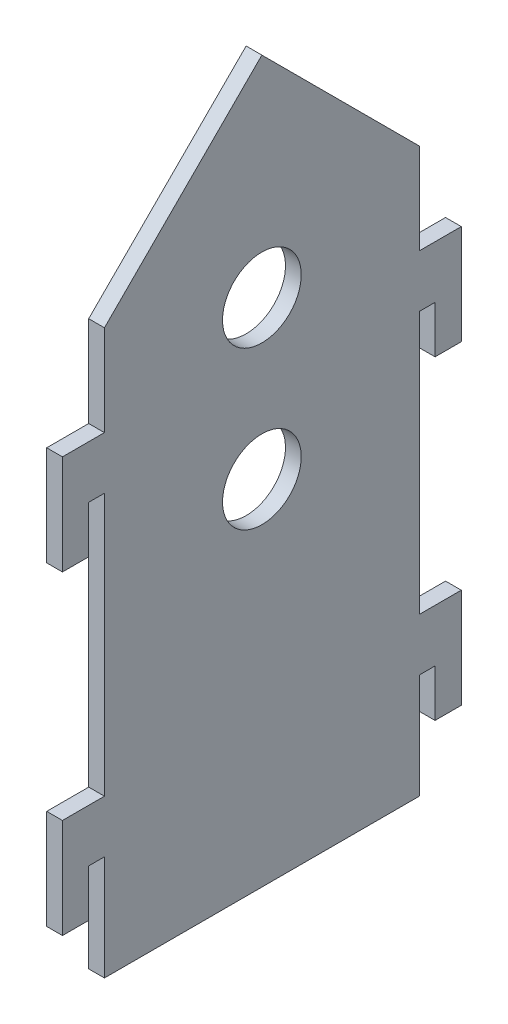
ISO-10303-21;
HEADER;
FILE_DESCRIPTION(('STEP AP214'),'2;1');
FILE_NAME('part.step','',(''),(''),'','','');
FILE_SCHEMA(('AUTOMOTIVE_DESIGN { 1 0 10303 214 1 1 1 1 }'));
ENDSEC;
DATA;
#1=APPLICATION_CONTEXT('core data for automotive mechanical design processes');
#2=APPLICATION_PROTOCOL_DEFINITION('international standard','automotive_design',2000,#1);
#3=PRODUCT_CONTEXT('',#1,'mechanical');
#4=PRODUCT('Part','Part','',(#3));
#5=PRODUCT_RELATED_PRODUCT_CATEGORY('part','',(#4));
#6=PRODUCT_DEFINITION_FORMATION('','',#4);
#7=PRODUCT_DEFINITION_CONTEXT('part definition',#1,'design');
#8=PRODUCT_DEFINITION('design','',#6,#7);
#9=PRODUCT_DEFINITION_SHAPE('','',#8);
#10=(LENGTH_UNIT() NAMED_UNIT(*) SI_UNIT(.MILLI.,.METRE.));
#11=(NAMED_UNIT(*) PLANE_ANGLE_UNIT() SI_UNIT($,.RADIAN.));
#12=(NAMED_UNIT(*) SI_UNIT($,.STERADIAN.) SOLID_ANGLE_UNIT());
#13=UNCERTAINTY_MEASURE_WITH_UNIT(LENGTH_MEASURE(1.E-05),#10,'distance_accuracy_value','');
#14=(GEOMETRIC_REPRESENTATION_CONTEXT(3) GLOBAL_UNCERTAINTY_ASSIGNED_CONTEXT((#13)) GLOBAL_UNIT_ASSIGNED_CONTEXT((#10,
#11,#12)) REPRESENTATION_CONTEXT('',''));
#15=CARTESIAN_POINT('',(0.,0.,0.));
#16=DIRECTION('',(0.,0.,1.));
#17=DIRECTION('',(1.,0.,0.));
#18=AXIS2_PLACEMENT_3D('',#15,#16,#17);
#19=CARTESIAN_POINT('',(-63.,0.,0.));
#20=DIRECTION('',(-1.,0.,0.));
#21=DIRECTION('',(0.,0.,1.));
#22=AXIS2_PLACEMENT_3D('',#19,#20,#21);
#23=PLANE('',#22);
#24=CARTESIAN_POINT('',(-63.,137.3,-33.));
#25=DIRECTION('',(-1.,0.,0.));
#26=DIRECTION('',(0.,0.,1.));
#27=AXIS2_PLACEMENT_3D('',#24,#25,#26);
#28=CIRCLE('',#27,7.4999999999999);
#29=CARTESIAN_POINT('',(-63.,137.3,-25.5000000000001));
#30=VERTEX_POINT('',#29);
#31=EDGE_CURVE('E262',#30,#30,#28,.T.);
#32=ORIENTED_EDGE('',*,*,#31,.F.);
#33=EDGE_LOOP('',(#32));
#34=FACE_BOUND('',#33,.T.);
#35=DIRECTION('',(0.,-1.,0.));
#36=VECTOR('',#35,1.);
#37=CARTESIAN_POINT('',(-63.,40.,-63.));
#38=LINE('',#37,#36);
#39=CARTESIAN_POINT('',(-63.,60.,-63.));
#40=VERTEX_POINT('',#39);
#41=CARTESIAN_POINT('',(-63.,40.,-63.));
#42=VERTEX_POINT('',#41);
#43=EDGE_CURVE('E315',#40,#42,#38,.T.);
#44=ORIENTED_EDGE('',*,*,#43,.T.);
#45=DIRECTION('',(0.,0.,1.));
#46=VECTOR('',#45,1.);
#47=CARTESIAN_POINT('',(-63.,40.,-63.));
#48=LINE('',#47,#46);
#49=CARTESIAN_POINT('',(-63.,40.,-3.00000000000002));
#50=VERTEX_POINT('',#49);
#51=EDGE_CURVE('E158',#42,#50,#48,.T.);
#52=ORIENTED_EDGE('',*,*,#51,.T.);
#53=DIRECTION('',(0.,1.,0.));
#54=VECTOR('',#53,1.);
#55=CARTESIAN_POINT('',(-63.,40.,-3.00000000000002));
#56=LINE('',#55,#54);
#57=CARTESIAN_POINT('',(-63.,60.,-3.00000000000002));
#58=VERTEX_POINT('',#57);
#59=EDGE_CURVE('E393',#50,#58,#56,.T.);
#60=ORIENTED_EDGE('',*,*,#59,.T.);
#61=DIRECTION('',(0.,0.,1.));
#62=VECTOR('',#61,1.);
#63=CARTESIAN_POINT('',(-63.,60.,-3.00000000000002));
#64=LINE('',#63,#62);
#65=CARTESIAN_POINT('',(-63.,60.,0.));
#66=VERTEX_POINT('',#65);
#67=EDGE_CURVE('E412',#58,#66,#64,.T.);
#68=ORIENTED_EDGE('',*,*,#67,.T.);
#69=DIRECTION('',(0.,-1.,0.));
#70=VECTOR('',#69,1.);
#71=CARTESIAN_POINT('',(-63.,60.,0.));
#72=LINE('',#71,#70);
#73=CARTESIAN_POINT('',(-63.,51.,0.));
#74=VERTEX_POINT('',#73);
#75=EDGE_CURVE('E409',#66,#74,#72,.T.);
#76=ORIENTED_EDGE('',*,*,#75,.T.);
#77=DIRECTION('',(0.,0.,1.));
#78=VECTOR('',#77,1.);
#79=CARTESIAN_POINT('',(-63.,51.,4.99999999999999));
#80=LINE('',#79,#78);
#81=CARTESIAN_POINT('',(-63.,51.,4.99999999999999));
#82=VERTEX_POINT('',#81);
#83=EDGE_CURVE('E411',#74,#82,#80,.T.);
#84=ORIENTED_EDGE('',*,*,#83,.T.);
#85=DIRECTION('',(0.,1.,0.));
#86=VECTOR('',#85,1.);
#87=CARTESIAN_POINT('',(-63.,70.,4.99999999999998));
#88=LINE('',#87,#86);
#89=CARTESIAN_POINT('',(-63.,70.,4.99999999999998));
#90=VERTEX_POINT('',#89);
#91=EDGE_CURVE('E414',#82,#90,#88,.T.);
#92=ORIENTED_EDGE('',*,*,#91,.T.);
#93=DIRECTION('',(0.,0.,-1.));
#94=VECTOR('',#93,1.);
#95=CARTESIAN_POINT('',(-63.,70.,-3.00000000000002));
#96=LINE('',#95,#94);
#97=CARTESIAN_POINT('',(-63.,70.,-3.00000000000002));
#98=VERTEX_POINT('',#97);
#99=EDGE_CURVE('E420',#90,#98,#96,.T.);
#100=ORIENTED_EDGE('',*,*,#99,.T.);
#101=DIRECTION('',(0.,1.,0.));
#102=VECTOR('',#101,1.);
#103=CARTESIAN_POINT('',(-63.,70.,-3.00000000000002));
#104=LINE('',#103,#102);
#105=CARTESIAN_POINT('',(-63.,120.,-3.));
#106=VERTEX_POINT('',#105);
#107=EDGE_CURVE('E422',#98,#106,#104,.T.);
#108=ORIENTED_EDGE('',*,*,#107,.T.);
#109=DIRECTION('',(0.,0.,1.));
#110=VECTOR('',#109,1.);
#111=CARTESIAN_POINT('',(-63.,120.,-3.));
#112=LINE('',#111,#110);
#113=CARTESIAN_POINT('',(-63.,120.,0.));
#114=VERTEX_POINT('',#113);
#115=EDGE_CURVE('E424',#106,#114,#112,.T.);
#116=ORIENTED_EDGE('',*,*,#115,.T.);
#117=DIRECTION('',(0.,-1.,0.));
#118=VECTOR('',#117,1.);
#119=CARTESIAN_POINT('',(-63.,120.,0.));
#120=LINE('',#119,#118);
#121=CARTESIAN_POINT('',(-63.,111.,0.));
#122=VERTEX_POINT('',#121);
#123=EDGE_CURVE('E426',#114,#122,#120,.T.);
#124=ORIENTED_EDGE('',*,*,#123,.T.);
#125=DIRECTION('',(0.,0.,1.));
#126=VECTOR('',#125,1.);
#127=CARTESIAN_POINT('',(-63.,111.,5.));
#128=LINE('',#127,#126);
#129=CARTESIAN_POINT('',(-63.,111.,5.));
#130=VERTEX_POINT('',#129);
#131=EDGE_CURVE('E428',#122,#130,#128,.T.);
#132=ORIENTED_EDGE('',*,*,#131,.T.);
#133=DIRECTION('',(0.,1.,0.));
#134=VECTOR('',#133,1.);
#135=CARTESIAN_POINT('',(-63.,130.,5.));
#136=LINE('',#135,#134);
#137=CARTESIAN_POINT('',(-63.,130.,5.));
#138=VERTEX_POINT('',#137);
#139=EDGE_CURVE('E430',#130,#138,#136,.T.);
#140=ORIENTED_EDGE('',*,*,#139,.T.);
#141=DIRECTION('',(0.,0.,-1.));
#142=VECTOR('',#141,1.);
#143=CARTESIAN_POINT('',(-63.,130.,-3.));
#144=LINE('',#143,#142);
#145=CARTESIAN_POINT('',(-63.,130.,-3.));
#146=VERTEX_POINT('',#145);
#147=EDGE_CURVE('E432',#138,#146,#144,.T.);
#148=ORIENTED_EDGE('',*,*,#147,.T.);
#149=DIRECTION('',(0.,1.,0.));
#150=VECTOR('',#149,1.);
#151=CARTESIAN_POINT('',(-63.,130.,-3.));
#152=LINE('',#151,#150);
#153=CARTESIAN_POINT('',(-63.,147.3,-3.00000000000002));
#154=VERTEX_POINT('',#153);
#155=EDGE_CURVE('E434',#146,#154,#152,.T.);
#156=ORIENTED_EDGE('',*,*,#155,.T.);
#157=DIRECTION('',(0.,0.707106781186546,-0.707106781186549));
#158=VECTOR('',#157,1.);
#159=CARTESIAN_POINT('',(-63.,147.3,-3.00000000000002));
#160=LINE('',#159,#158);
#161=CARTESIAN_POINT('',(-63.,177.3,-33.0000000000001));
#162=VERTEX_POINT('',#161);
#163=EDGE_CURVE('E436',#154,#162,#160,.T.);
#164=ORIENTED_EDGE('',*,*,#163,.T.);
#165=DIRECTION('',(0.,-0.707106781186549,-0.707106781186546));
#166=VECTOR('',#165,1.);
#167=CARTESIAN_POINT('',(-63.,147.3,-63.));
#168=LINE('',#167,#166);
#169=CARTESIAN_POINT('',(-63.,147.3,-63.));
#170=VERTEX_POINT('',#169);
#171=EDGE_CURVE('E438',#162,#170,#168,.T.);
#172=ORIENTED_EDGE('',*,*,#171,.T.);
#173=DIRECTION('',(0.,-1.,0.));
#174=VECTOR('',#173,1.);
#175=CARTESIAN_POINT('',(-63.,130.,-63.));
#176=LINE('',#175,#174);
#177=CARTESIAN_POINT('',(-63.,130.,-63.));
#178=VERTEX_POINT('',#177);
#179=EDGE_CURVE('E440',#170,#178,#176,.T.);
#180=ORIENTED_EDGE('',*,*,#179,.T.);
#181=DIRECTION('',(0.,0.,-1.));
#182=VECTOR('',#181,1.);
#183=CARTESIAN_POINT('',(-63.,130.,-63.));
#184=LINE('',#183,#182);
#185=CARTESIAN_POINT('',(-63.,130.,-71.));
#186=VERTEX_POINT('',#185);
#187=EDGE_CURVE('E442',#178,#186,#184,.T.);
#188=ORIENTED_EDGE('',*,*,#187,.T.);
#189=DIRECTION('',(0.,-1.,0.));
#190=VECTOR('',#189,1.);
#191=CARTESIAN_POINT('',(-63.,130.,-71.));
#192=LINE('',#191,#190);
#193=CARTESIAN_POINT('',(-63.,111.,-71.));
#194=VERTEX_POINT('',#193);
#195=EDGE_CURVE('E444',#186,#194,#192,.T.);
#196=ORIENTED_EDGE('',*,*,#195,.T.);
#197=DIRECTION('',(0.,0.,1.));
#198=VECTOR('',#197,1.);
#199=CARTESIAN_POINT('',(-63.,111.,-66.));
#200=LINE('',#199,#198);
#201=CARTESIAN_POINT('',(-63.,111.,-66.));
#202=VERTEX_POINT('',#201);
#203=EDGE_CURVE('E446',#194,#202,#200,.T.);
#204=ORIENTED_EDGE('',*,*,#203,.T.);
#205=DIRECTION('',(0.,1.,0.));
#206=VECTOR('',#205,1.);
#207=CARTESIAN_POINT('',(-63.,120.,-66.));
#208=LINE('',#207,#206);
#209=CARTESIAN_POINT('',(-63.,120.,-66.));
#210=VERTEX_POINT('',#209);
#211=EDGE_CURVE('E448',#202,#210,#208,.T.);
#212=ORIENTED_EDGE('',*,*,#211,.T.);
#213=DIRECTION('',(0.,0.,1.));
#214=VECTOR('',#213,1.);
#215=CARTESIAN_POINT('',(-63.,120.,-63.));
#216=LINE('',#215,#214);
#217=CARTESIAN_POINT('',(-63.,120.,-63.));
#218=VERTEX_POINT('',#217);
#219=EDGE_CURVE('E450',#210,#218,#216,.T.);
#220=ORIENTED_EDGE('',*,*,#219,.T.);
#221=DIRECTION('',(0.,-1.,0.));
#222=VECTOR('',#221,1.);
#223=CARTESIAN_POINT('',(-63.,70.,-63.));
#224=LINE('',#223,#222);
#225=CARTESIAN_POINT('',(-63.,70.,-63.));
#226=VERTEX_POINT('',#225);
#227=EDGE_CURVE('E452',#218,#226,#224,.T.);
#228=ORIENTED_EDGE('',*,*,#227,.T.);
#229=DIRECTION('',(0.,0.,-1.));
#230=VECTOR('',#229,1.);
#231=CARTESIAN_POINT('',(-63.,70.,-63.));
#232=LINE('',#231,#230);
#233=CARTESIAN_POINT('',(-63.,70.,-71.));
#234=VERTEX_POINT('',#233);
#235=EDGE_CURVE('E454',#226,#234,#232,.T.);
#236=ORIENTED_EDGE('',*,*,#235,.T.);
#237=DIRECTION('',(0.,-1.,0.));
#238=VECTOR('',#237,1.);
#239=CARTESIAN_POINT('',(-63.,70.,-71.));
#240=LINE('',#239,#238);
#241=CARTESIAN_POINT('',(-63.,51.,-71.));
#242=VERTEX_POINT('',#241);
#243=EDGE_CURVE('E240',#234,#242,#240,.T.);
#244=ORIENTED_EDGE('',*,*,#243,.T.);
#245=DIRECTION('',(0.,0.,1.));
#246=VECTOR('',#245,1.);
#247=CARTESIAN_POINT('',(-63.,51.,-71.));
#248=LINE('',#247,#246);
#249=CARTESIAN_POINT('',(-63.,51.,-66.));
#250=VERTEX_POINT('',#249);
#251=EDGE_CURVE('E234',#242,#250,#248,.T.);
#252=ORIENTED_EDGE('',*,*,#251,.T.);
#253=DIRECTION('',(0.,1.,0.));
#254=VECTOR('',#253,1.);
#255=CARTESIAN_POINT('',(-63.,60.,-66.));
#256=LINE('',#255,#254);
#257=CARTESIAN_POINT('',(-63.,60.,-66.));
#258=VERTEX_POINT('',#257);
#259=EDGE_CURVE('E238',#250,#258,#256,.T.);
#260=ORIENTED_EDGE('',*,*,#259,.T.);
#261=DIRECTION('',(0.,0.,1.));
#262=VECTOR('',#261,1.);
#263=CARTESIAN_POINT('',(-63.,60.,-63.));
#264=LINE('',#263,#262);
#265=EDGE_CURVE('E52',#258,#40,#264,.T.);
#266=ORIENTED_EDGE('',*,*,#265,.T.);
#267=EDGE_LOOP('',(#44,#52,#60,#68,#76,#84,#92,#100,#108,#116,#124,#132,#140,#148,#156,#164,
#172,#180,#188,#196,#204,#212,#220,#228,#236,#244,#252,#260,#266));
#268=FACE_BOUND('',#267,.T.);
#269=CARTESIAN_POINT('',(-63.,107.3,-33.));
#270=DIRECTION('',(-1.,0.,0.));
#271=DIRECTION('',(0.,0.,1.));
#272=AXIS2_PLACEMENT_3D('',#269,#270,#271);
#273=CIRCLE('',#272,7.4999999999999);
#274=CARTESIAN_POINT('',(-63.,107.3,-25.5000000000001));
#275=VERTEX_POINT('',#274);
#276=EDGE_CURVE('E496',#275,#275,#273,.T.);
#277=ORIENTED_EDGE('',*,*,#276,.F.);
#278=EDGE_LOOP('',(#277));
#279=FACE_BOUND('',#278,.T.);
#280=ADVANCED_FACE('F35',(#34,#268,#279),#23,.T.);
#281=CARTESIAN_POINT('',(-60.,0.,0.));
#282=DIRECTION('',(-1.,0.,0.));
#283=DIRECTION('',(0.,0.,1.));
#284=AXIS2_PLACEMENT_3D('',#281,#282,#283);
#285=PLANE('',#284);
#286=DIRECTION('',(0.,-1.,0.));
#287=VECTOR('',#286,1.);
#288=CARTESIAN_POINT('',(-60.,40.,-63.));
#289=LINE('',#288,#287);
#290=CARTESIAN_POINT('',(-60.,60.,-63.));
#291=VERTEX_POINT('',#290);
#292=CARTESIAN_POINT('',(-60.,40.,-63.));
#293=VERTEX_POINT('',#292);
#294=EDGE_CURVE('E258',#291,#293,#289,.T.);
#295=ORIENTED_EDGE('',*,*,#294,.F.);
#296=DIRECTION('',(0.,0.,1.));
#297=VECTOR('',#296,1.);
#298=CARTESIAN_POINT('',(-60.,60.,-63.));
#299=LINE('',#298,#297);
#300=CARTESIAN_POINT('',(-60.,60.,-66.));
#301=VERTEX_POINT('',#300);
#302=EDGE_CURVE('E150',#301,#291,#299,.T.);
#303=ORIENTED_EDGE('',*,*,#302,.F.);
#304=DIRECTION('',(0.,1.,0.));
#305=VECTOR('',#304,1.);
#306=CARTESIAN_POINT('',(-60.,60.,-66.));
#307=LINE('',#306,#305);
#308=CARTESIAN_POINT('',(-60.,51.,-66.));
#309=VERTEX_POINT('',#308);
#310=EDGE_CURVE('E144',#309,#301,#307,.T.);
#311=ORIENTED_EDGE('',*,*,#310,.F.);
#312=DIRECTION('',(0.,0.,1.));
#313=VECTOR('',#312,1.);
#314=CARTESIAN_POINT('',(-60.,51.,-71.));
#315=LINE('',#314,#313);
#316=CARTESIAN_POINT('',(-60.,51.,-71.));
#317=VERTEX_POINT('',#316);
#318=EDGE_CURVE('E248',#317,#309,#315,.T.);
#319=ORIENTED_EDGE('',*,*,#318,.F.);
#320=DIRECTION('',(0.,-1.,0.));
#321=VECTOR('',#320,1.);
#322=CARTESIAN_POINT('',(-60.,70.,-71.));
#323=LINE('',#322,#321);
#324=CARTESIAN_POINT('',(-60.,70.,-71.));
#325=VERTEX_POINT('',#324);
#326=EDGE_CURVE('E310',#325,#317,#323,.T.);
#327=ORIENTED_EDGE('',*,*,#326,.F.);
#328=DIRECTION('',(0.,0.,-1.));
#329=VECTOR('',#328,1.);
#330=CARTESIAN_POINT('',(-60.,70.,-63.));
#331=LINE('',#330,#329);
#332=CARTESIAN_POINT('',(-60.,70.,-63.));
#333=VERTEX_POINT('',#332);
#334=EDGE_CURVE('E308',#333,#325,#331,.T.);
#335=ORIENTED_EDGE('',*,*,#334,.F.);
#336=DIRECTION('',(0.,-1.,0.));
#337=VECTOR('',#336,1.);
#338=CARTESIAN_POINT('',(-60.,70.,-63.));
#339=LINE('',#338,#337);
#340=CARTESIAN_POINT('',(-60.,120.,-63.));
#341=VERTEX_POINT('',#340);
#342=EDGE_CURVE('E306',#341,#333,#339,.T.);
#343=ORIENTED_EDGE('',*,*,#342,.F.);
#344=DIRECTION('',(0.,0.,1.));
#345=VECTOR('',#344,1.);
#346=CARTESIAN_POINT('',(-60.,120.,-63.));
#347=LINE('',#346,#345);
#348=CARTESIAN_POINT('',(-60.,120.,-66.));
#349=VERTEX_POINT('',#348);
#350=EDGE_CURVE('E304',#349,#341,#347,.T.);
#351=ORIENTED_EDGE('',*,*,#350,.F.);
#352=DIRECTION('',(0.,1.,0.));
#353=VECTOR('',#352,1.);
#354=CARTESIAN_POINT('',(-60.,120.,-66.));
#355=LINE('',#354,#353);
#356=CARTESIAN_POINT('',(-60.,111.,-66.));
#357=VERTEX_POINT('',#356);
#358=EDGE_CURVE('E302',#357,#349,#355,.T.);
#359=ORIENTED_EDGE('',*,*,#358,.F.);
#360=DIRECTION('',(0.,0.,1.));
#361=VECTOR('',#360,1.);
#362=CARTESIAN_POINT('',(-60.,111.,-66.));
#363=LINE('',#362,#361);
#364=CARTESIAN_POINT('',(-60.,111.,-71.));
#365=VERTEX_POINT('',#364);
#366=EDGE_CURVE('E300',#365,#357,#363,.T.);
#367=ORIENTED_EDGE('',*,*,#366,.F.);
#368=DIRECTION('',(0.,-1.,0.));
#369=VECTOR('',#368,1.);
#370=CARTESIAN_POINT('',(-60.,130.,-71.));
#371=LINE('',#370,#369);
#372=CARTESIAN_POINT('',(-60.,130.,-71.));
#373=VERTEX_POINT('',#372);
#374=EDGE_CURVE('E298',#373,#365,#371,.T.);
#375=ORIENTED_EDGE('',*,*,#374,.F.);
#376=DIRECTION('',(0.,0.,-1.));
#377=VECTOR('',#376,1.);
#378=CARTESIAN_POINT('',(-60.,130.,-63.));
#379=LINE('',#378,#377);
#380=CARTESIAN_POINT('',(-60.,130.,-63.));
#381=VERTEX_POINT('',#380);
#382=EDGE_CURVE('E296',#381,#373,#379,.T.);
#383=ORIENTED_EDGE('',*,*,#382,.F.);
#384=DIRECTION('',(0.,-1.,0.));
#385=VECTOR('',#384,1.);
#386=CARTESIAN_POINT('',(-60.,130.,-63.));
#387=LINE('',#386,#385);
#388=CARTESIAN_POINT('',(-60.,147.3,-63.));
#389=VERTEX_POINT('',#388);
#390=EDGE_CURVE('E294',#389,#381,#387,.T.);
#391=ORIENTED_EDGE('',*,*,#390,.F.);
#392=DIRECTION('',(0.,-0.707106781186549,-0.707106781186546));
#393=VECTOR('',#392,1.);
#394=CARTESIAN_POINT('',(-60.,147.3,-63.));
#395=LINE('',#394,#393);
#396=CARTESIAN_POINT('',(-60.,177.3,-33.0000000000001));
#397=VERTEX_POINT('',#396);
#398=EDGE_CURVE('E292',#397,#389,#395,.T.);
#399=ORIENTED_EDGE('',*,*,#398,.F.);
#400=DIRECTION('',(0.,0.707106781186546,-0.707106781186549));
#401=VECTOR('',#400,1.);
#402=CARTESIAN_POINT('',(-60.,147.3,-3.00000000000002));
#403=LINE('',#402,#401);
#404=CARTESIAN_POINT('',(-60.,147.3,-3.00000000000002));
#405=VERTEX_POINT('',#404);
#406=EDGE_CURVE('E290',#405,#397,#403,.T.);
#407=ORIENTED_EDGE('',*,*,#406,.F.);
#408=DIRECTION('',(0.,1.,0.));
#409=VECTOR('',#408,1.);
#410=CARTESIAN_POINT('',(-60.,130.,-3.));
#411=LINE('',#410,#409);
#412=CARTESIAN_POINT('',(-60.,130.,-3.));
#413=VERTEX_POINT('',#412);
#414=EDGE_CURVE('E288',#413,#405,#411,.T.);
#415=ORIENTED_EDGE('',*,*,#414,.F.);
#416=DIRECTION('',(0.,0.,-1.));
#417=VECTOR('',#416,1.);
#418=CARTESIAN_POINT('',(-60.,130.,-3.));
#419=LINE('',#418,#417);
#420=CARTESIAN_POINT('',(-60.,130.,5.));
#421=VERTEX_POINT('',#420);
#422=EDGE_CURVE('E286',#421,#413,#419,.T.);
#423=ORIENTED_EDGE('',*,*,#422,.F.);
#424=DIRECTION('',(0.,1.,0.));
#425=VECTOR('',#424,1.);
#426=CARTESIAN_POINT('',(-60.,130.,5.));
#427=LINE('',#426,#425);
#428=CARTESIAN_POINT('',(-60.,111.,5.));
#429=VERTEX_POINT('',#428);
#430=EDGE_CURVE('E284',#429,#421,#427,.T.);
#431=ORIENTED_EDGE('',*,*,#430,.F.);
#432=DIRECTION('',(0.,0.,1.));
#433=VECTOR('',#432,1.);
#434=CARTESIAN_POINT('',(-60.,111.,5.));
#435=LINE('',#434,#433);
#436=CARTESIAN_POINT('',(-60.,111.,0.));
#437=VERTEX_POINT('',#436);
#438=EDGE_CURVE('E282',#437,#429,#435,.T.);
#439=ORIENTED_EDGE('',*,*,#438,.F.);
#440=DIRECTION('',(0.,-1.,0.));
#441=VECTOR('',#440,1.);
#442=CARTESIAN_POINT('',(-60.,120.,0.));
#443=LINE('',#442,#441);
#444=CARTESIAN_POINT('',(-60.,120.,0.));
#445=VERTEX_POINT('',#444);
#446=EDGE_CURVE('E280',#445,#437,#443,.T.);
#447=ORIENTED_EDGE('',*,*,#446,.F.);
#448=DIRECTION('',(0.,0.,1.));
#449=VECTOR('',#448,1.);
#450=CARTESIAN_POINT('',(-60.,120.,-3.));
#451=LINE('',#450,#449);
#452=CARTESIAN_POINT('',(-60.,120.,-3.));
#453=VERTEX_POINT('',#452);
#454=EDGE_CURVE('E278',#453,#445,#451,.T.);
#455=ORIENTED_EDGE('',*,*,#454,.F.);
#456=DIRECTION('',(0.,1.,0.));
#457=VECTOR('',#456,1.);
#458=CARTESIAN_POINT('',(-60.,70.,-3.00000000000002));
#459=LINE('',#458,#457);
#460=CARTESIAN_POINT('',(-60.,70.,-3.00000000000002));
#461=VERTEX_POINT('',#460);
#462=EDGE_CURVE('E276',#461,#453,#459,.T.);
#463=ORIENTED_EDGE('',*,*,#462,.F.);
#464=DIRECTION('',(0.,0.,-1.));
#465=VECTOR('',#464,1.);
#466=CARTESIAN_POINT('',(-60.,70.,-3.00000000000002));
#467=LINE('',#466,#465);
#468=CARTESIAN_POINT('',(-60.,70.,4.99999999999998));
#469=VERTEX_POINT('',#468);
#470=EDGE_CURVE('E274',#469,#461,#467,.T.);
#471=ORIENTED_EDGE('',*,*,#470,.F.);
#472=DIRECTION('',(0.,1.,0.));
#473=VECTOR('',#472,1.);
#474=CARTESIAN_POINT('',(-60.,70.,4.99999999999998));
#475=LINE('',#474,#473);
#476=CARTESIAN_POINT('',(-60.,51.,4.99999999999999));
#477=VERTEX_POINT('',#476);
#478=EDGE_CURVE('E272',#477,#469,#475,.T.);
#479=ORIENTED_EDGE('',*,*,#478,.F.);
#480=DIRECTION('',(0.,0.,1.));
#481=VECTOR('',#480,1.);
#482=CARTESIAN_POINT('',(-60.,51.,4.99999999999999));
#483=LINE('',#482,#481);
#484=CARTESIAN_POINT('',(-60.,51.,0.));
#485=VERTEX_POINT('',#484);
#486=EDGE_CURVE('E270',#485,#477,#483,.T.);
#487=ORIENTED_EDGE('',*,*,#486,.F.);
#488=DIRECTION('',(0.,-1.,0.));
#489=VECTOR('',#488,1.);
#490=CARTESIAN_POINT('',(-60.,60.,0.));
#491=LINE('',#490,#489);
#492=CARTESIAN_POINT('',(-60.,60.,0.));
#493=VERTEX_POINT('',#492);
#494=EDGE_CURVE('E268',#493,#485,#491,.T.);
#495=ORIENTED_EDGE('',*,*,#494,.F.);
#496=DIRECTION('',(0.,0.,1.));
#497=VECTOR('',#496,1.);
#498=CARTESIAN_POINT('',(-60.,60.,-3.00000000000002));
#499=LINE('',#498,#497);
#500=CARTESIAN_POINT('',(-60.,60.,-3.00000000000002));
#501=VERTEX_POINT('',#500);
#502=EDGE_CURVE('E266',#501,#493,#499,.T.);
#503=ORIENTED_EDGE('',*,*,#502,.F.);
#504=DIRECTION('',(0.,1.,0.));
#505=VECTOR('',#504,1.);
#506=CARTESIAN_POINT('',(-60.,40.,-3.00000000000002));
#507=LINE('',#506,#505);
#508=CARTESIAN_POINT('',(-60.,40.,-3.00000000000002));
#509=VERTEX_POINT('',#508);
#510=EDGE_CURVE('E264',#509,#501,#507,.T.);
#511=ORIENTED_EDGE('',*,*,#510,.F.);
#512=DIRECTION('',(0.,0.,1.));
#513=VECTOR('',#512,1.);
#514=CARTESIAN_POINT('',(-60.,40.,-63.));
#515=LINE('',#514,#513);
#516=EDGE_CURVE('E261',#293,#509,#515,.T.);
#517=ORIENTED_EDGE('',*,*,#516,.F.);
#518=EDGE_LOOP('',(#295,#303,#311,#319,#327,#335,#343,#351,#359,#367,#375,#383,#391,#399,#407,
#415,#423,#431,#439,#447,#455,#463,#471,#479,#487,#495,#503,#511,#517));
#519=FACE_BOUND('',#518,.T.);
#520=CARTESIAN_POINT('',(-60.,137.3,-33.));
#521=DIRECTION('',(-1.,0.,0.));
#522=DIRECTION('',(0.,0.,1.));
#523=AXIS2_PLACEMENT_3D('',#520,#521,#522);
#524=CIRCLE('',#523,7.4999999999999);
#525=CARTESIAN_POINT('',(-60.,137.3,-25.5000000000001));
#526=VERTEX_POINT('',#525);
#527=EDGE_CURVE('E502',#526,#526,#524,.T.);
#528=ORIENTED_EDGE('',*,*,#527,.T.);
#529=EDGE_LOOP('',(#528));
#530=FACE_BOUND('',#529,.T.);
#531=CARTESIAN_POINT('',(-60.,107.3,-33.));
#532=DIRECTION('',(-1.,0.,0.));
#533=DIRECTION('',(0.,0.,1.));
#534=AXIS2_PLACEMENT_3D('',#531,#532,#533);
#535=CIRCLE('',#534,7.4999999999999);
#536=CARTESIAN_POINT('',(-60.,107.3,-25.5000000000001));
#537=VERTEX_POINT('',#536);
#538=EDGE_CURVE('E499',#537,#537,#535,.T.);
#539=ORIENTED_EDGE('',*,*,#538,.T.);
#540=EDGE_LOOP('',(#539));
#541=FACE_BOUND('',#540,.T.);
#542=ADVANCED_FACE('F397',(#519,#530,#541),#285,.F.);
#543=CARTESIAN_POINT('',(-63.,40.,-63.));
#544=DIRECTION('',(0.,0.,1.));
#545=DIRECTION('',(1.,0.,0.));
#546=AXIS2_PLACEMENT_3D('',#543,#544,#545);
#547=PLANE('',#546);
#548=ORIENTED_EDGE('',*,*,#294,.T.);
#549=DIRECTION('',(1.,0.,0.));
#550=VECTOR('',#549,1.);
#551=CARTESIAN_POINT('',(-63.,40.,-63.));
#552=LINE('',#551,#550);
#553=EDGE_CURVE('E11',#42,#293,#552,.T.);
#554=ORIENTED_EDGE('',*,*,#553,.F.);
#555=ORIENTED_EDGE('',*,*,#43,.F.);
#556=DIRECTION('',(1.,0.,0.));
#557=VECTOR('',#556,1.);
#558=CARTESIAN_POINT('',(-63.,60.,-63.));
#559=LINE('',#558,#557);
#560=EDGE_CURVE('E254',#40,#291,#559,.T.);
#561=ORIENTED_EDGE('',*,*,#560,.T.);
#562=EDGE_LOOP('',(#548,#554,#555,#561));
#563=FACE_BOUND('',#562,.T.);
#564=ADVANCED_FACE('F37',(#563),#547,.F.);
#565=CARTESIAN_POINT('',(-63.,40.,-63.));
#566=DIRECTION('',(0.,1.,0.));
#567=DIRECTION('',(0.,0.,1.));
#568=AXIS2_PLACEMENT_3D('',#565,#566,#567);
#569=PLANE('',#568);
#570=ORIENTED_EDGE('',*,*,#516,.T.);
#571=DIRECTION('',(1.,0.,0.));
#572=VECTOR('',#571,1.);
#573=CARTESIAN_POINT('',(-63.,40.,-3.00000000000002));
#574=LINE('',#573,#572);
#575=EDGE_CURVE('E44',#50,#509,#574,.T.);
#576=ORIENTED_EDGE('',*,*,#575,.F.);
#577=ORIENTED_EDGE('',*,*,#51,.F.);
#578=ORIENTED_EDGE('',*,*,#553,.T.);
#579=EDGE_LOOP('',(#570,#576,#577,#578));
#580=FACE_BOUND('',#579,.T.);
#581=ADVANCED_FACE('F768',(#580),#569,.F.);
#582=CARTESIAN_POINT('',(-63.,40.,-3.00000000000002));
#583=DIRECTION('',(0.,0.,-1.));
#584=DIRECTION('',(-1.,0.,0.));
#585=AXIS2_PLACEMENT_3D('',#582,#583,#584);
#586=PLANE('',#585);
#587=ORIENTED_EDGE('',*,*,#510,.T.);
#588=DIRECTION('',(1.,0.,0.));
#589=VECTOR('',#588,1.);
#590=CARTESIAN_POINT('',(-63.,60.,-3.00000000000002));
#591=LINE('',#590,#589);
#592=EDGE_CURVE('E385',#58,#501,#591,.T.);
#593=ORIENTED_EDGE('',*,*,#592,.F.);
#594=ORIENTED_EDGE('',*,*,#59,.F.);
#595=ORIENTED_EDGE('',*,*,#575,.T.);
#596=EDGE_LOOP('',(#587,#593,#594,#595));
#597=FACE_BOUND('',#596,.T.);
#598=ADVANCED_FACE('F391',(#597),#586,.F.);
#599=CARTESIAN_POINT('',(-63.,60.,-3.00000000000002));
#600=DIRECTION('',(0.,1.,0.));
#601=DIRECTION('',(0.,0.,1.));
#602=AXIS2_PLACEMENT_3D('',#599,#600,#601);
#603=PLANE('',#602);
#604=ORIENTED_EDGE('',*,*,#502,.T.);
#605=DIRECTION('',(1.,0.,0.));
#606=VECTOR('',#605,1.);
#607=CARTESIAN_POINT('',(-63.,60.,0.));
#608=LINE('',#607,#606);
#609=EDGE_CURVE('E382',#66,#493,#608,.T.);
#610=ORIENTED_EDGE('',*,*,#609,.F.);
#611=ORIENTED_EDGE('',*,*,#67,.F.);
#612=ORIENTED_EDGE('',*,*,#592,.T.);
#613=EDGE_LOOP('',(#604,#610,#611,#612));
#614=FACE_BOUND('',#613,.T.);
#615=ADVANCED_FACE('F403',(#614),#603,.F.);
#616=CARTESIAN_POINT('',(-63.,60.,0.));
#617=DIRECTION('',(0.,0.,1.));
#618=DIRECTION('',(1.,0.,0.));
#619=AXIS2_PLACEMENT_3D('',#616,#617,#618);
#620=PLANE('',#619);
#621=ORIENTED_EDGE('',*,*,#494,.T.);
#622=DIRECTION('',(1.,0.,0.));
#623=VECTOR('',#622,1.);
#624=CARTESIAN_POINT('',(-63.,51.,0.));
#625=LINE('',#624,#623);
#626=EDGE_CURVE('E379',#74,#485,#625,.T.);
#627=ORIENTED_EDGE('',*,*,#626,.F.);
#628=ORIENTED_EDGE('',*,*,#75,.F.);
#629=ORIENTED_EDGE('',*,*,#609,.T.);
#630=EDGE_LOOP('',(#621,#627,#628,#629));
#631=FACE_BOUND('',#630,.T.);
#632=ADVANCED_FACE('F407',(#631),#620,.F.);
#633=CARTESIAN_POINT('',(-63.,51.,4.99999999999999));
#634=DIRECTION('',(0.,1.,0.));
#635=DIRECTION('',(0.,0.,1.));
#636=AXIS2_PLACEMENT_3D('',#633,#634,#635);
#637=PLANE('',#636);
#638=ORIENTED_EDGE('',*,*,#486,.T.);
#639=DIRECTION('',(1.,0.,0.));
#640=VECTOR('',#639,1.);
#641=CARTESIAN_POINT('',(-63.,51.,4.99999999999999));
#642=LINE('',#641,#640);
#643=EDGE_CURVE('E376',#82,#477,#642,.T.);
#644=ORIENTED_EDGE('',*,*,#643,.F.);
#645=ORIENTED_EDGE('',*,*,#83,.F.);
#646=ORIENTED_EDGE('',*,*,#626,.T.);
#647=EDGE_LOOP('',(#638,#644,#645,#646));
#648=FACE_BOUND('',#647,.T.);
#649=ADVANCED_FACE('F733',(#648),#637,.F.);
#650=CARTESIAN_POINT('',(-63.,70.,4.99999999999998));
#651=DIRECTION('',(0.,0.,-1.));
#652=DIRECTION('',(0.,1.,0.));
#653=AXIS2_PLACEMENT_3D('',#650,#651,#652);
#654=PLANE('',#653);
#655=ORIENTED_EDGE('',*,*,#478,.T.);
#656=DIRECTION('',(1.,0.,0.));
#657=VECTOR('',#656,1.);
#658=CARTESIAN_POINT('',(-63.,70.,4.99999999999998));
#659=LINE('',#658,#657);
#660=EDGE_CURVE('E373',#90,#469,#659,.T.);
#661=ORIENTED_EDGE('',*,*,#660,.F.);
#662=ORIENTED_EDGE('',*,*,#91,.F.);
#663=ORIENTED_EDGE('',*,*,#643,.T.);
#664=EDGE_LOOP('',(#655,#661,#662,#663));
#665=FACE_BOUND('',#664,.T.);
#666=ADVANCED_FACE('F723',(#665),#654,.F.);
#667=CARTESIAN_POINT('',(-63.,70.,-3.00000000000002));
#668=DIRECTION('',(0.,-1.,0.));
#669=DIRECTION('',(0.,0.,-1.));
#670=AXIS2_PLACEMENT_3D('',#667,#668,#669);
#671=PLANE('',#670);
#672=ORIENTED_EDGE('',*,*,#470,.T.);
#673=DIRECTION('',(1.,0.,0.));
#674=VECTOR('',#673,1.);
#675=CARTESIAN_POINT('',(-63.,70.,-3.00000000000002));
#676=LINE('',#675,#674);
#677=EDGE_CURVE('E370',#98,#461,#676,.T.);
#678=ORIENTED_EDGE('',*,*,#677,.F.);
#679=ORIENTED_EDGE('',*,*,#99,.F.);
#680=ORIENTED_EDGE('',*,*,#660,.T.);
#681=EDGE_LOOP('',(#672,#678,#679,#680));
#682=FACE_BOUND('',#681,.T.);
#683=ADVANCED_FACE('F713',(#682),#671,.F.);
#684=CARTESIAN_POINT('',(-63.,70.,-3.00000000000002));
#685=DIRECTION('',(0.,0.,-1.));
#686=DIRECTION('',(0.,1.,0.));
#687=AXIS2_PLACEMENT_3D('',#684,#685,#686);
#688=PLANE('',#687);
#689=ORIENTED_EDGE('',*,*,#462,.T.);
#690=DIRECTION('',(1.,0.,0.));
#691=VECTOR('',#690,1.);
#692=CARTESIAN_POINT('',(-63.,120.,-3.));
#693=LINE('',#692,#691);
#694=EDGE_CURVE('E367',#106,#453,#693,.T.);
#695=ORIENTED_EDGE('',*,*,#694,.F.);
#696=ORIENTED_EDGE('',*,*,#107,.F.);
#697=ORIENTED_EDGE('',*,*,#677,.T.);
#698=EDGE_LOOP('',(#689,#695,#696,#697));
#699=FACE_BOUND('',#698,.T.);
#700=ADVANCED_FACE('F703',(#699),#688,.F.);
#701=CARTESIAN_POINT('',(-63.,120.,-3.));
#702=DIRECTION('',(0.,1.,0.));
#703=DIRECTION('',(0.,0.,1.));
#704=AXIS2_PLACEMENT_3D('',#701,#702,#703);
#705=PLANE('',#704);
#706=ORIENTED_EDGE('',*,*,#454,.T.);
#707=DIRECTION('',(1.,0.,0.));
#708=VECTOR('',#707,1.);
#709=CARTESIAN_POINT('',(-63.,120.,0.));
#710=LINE('',#709,#708);
#711=EDGE_CURVE('E364',#114,#445,#710,.T.);
#712=ORIENTED_EDGE('',*,*,#711,.F.);
#713=ORIENTED_EDGE('',*,*,#115,.F.);
#714=ORIENTED_EDGE('',*,*,#694,.T.);
#715=EDGE_LOOP('',(#706,#712,#713,#714));
#716=FACE_BOUND('',#715,.T.);
#717=ADVANCED_FACE('F693',(#716),#705,.F.);
#718=CARTESIAN_POINT('',(-63.,120.,0.));
#719=DIRECTION('',(0.,0.,1.));
#720=DIRECTION('',(1.,0.,0.));
#721=AXIS2_PLACEMENT_3D('',#718,#719,#720);
#722=PLANE('',#721);
#723=ORIENTED_EDGE('',*,*,#446,.T.);
#724=DIRECTION('',(1.,0.,0.));
#725=VECTOR('',#724,1.);
#726=CARTESIAN_POINT('',(-63.,111.,0.));
#727=LINE('',#726,#725);
#728=EDGE_CURVE('E361',#122,#437,#727,.T.);
#729=ORIENTED_EDGE('',*,*,#728,.F.);
#730=ORIENTED_EDGE('',*,*,#123,.F.);
#731=ORIENTED_EDGE('',*,*,#711,.T.);
#732=EDGE_LOOP('',(#723,#729,#730,#731));
#733=FACE_BOUND('',#732,.T.);
#734=ADVANCED_FACE('F683',(#733),#722,.F.);
#735=CARTESIAN_POINT('',(-63.,111.,5.));
#736=DIRECTION('',(0.,1.,0.));
#737=DIRECTION('',(0.,0.,1.));
#738=AXIS2_PLACEMENT_3D('',#735,#736,#737);
#739=PLANE('',#738);
#740=ORIENTED_EDGE('',*,*,#438,.T.);
#741=DIRECTION('',(1.,0.,0.));
#742=VECTOR('',#741,1.);
#743=CARTESIAN_POINT('',(-63.,111.,5.));
#744=LINE('',#743,#742);
#745=EDGE_CURVE('E358',#130,#429,#744,.T.);
#746=ORIENTED_EDGE('',*,*,#745,.F.);
#747=ORIENTED_EDGE('',*,*,#131,.F.);
#748=ORIENTED_EDGE('',*,*,#728,.T.);
#749=EDGE_LOOP('',(#740,#746,#747,#748));
#750=FACE_BOUND('',#749,.T.);
#751=ADVANCED_FACE('F673',(#750),#739,.F.);
#752=CARTESIAN_POINT('',(-63.,130.,5.));
#753=DIRECTION('',(0.,0.,-1.));
#754=DIRECTION('',(0.,1.,0.));
#755=AXIS2_PLACEMENT_3D('',#752,#753,#754);
#756=PLANE('',#755);
#757=ORIENTED_EDGE('',*,*,#430,.T.);
#758=DIRECTION('',(1.,0.,0.));
#759=VECTOR('',#758,1.);
#760=CARTESIAN_POINT('',(-63.,130.,5.));
#761=LINE('',#760,#759);
#762=EDGE_CURVE('E355',#138,#421,#761,.T.);
#763=ORIENTED_EDGE('',*,*,#762,.F.);
#764=ORIENTED_EDGE('',*,*,#139,.F.);
#765=ORIENTED_EDGE('',*,*,#745,.T.);
#766=EDGE_LOOP('',(#757,#763,#764,#765));
#767=FACE_BOUND('',#766,.T.);
#768=ADVANCED_FACE('F663',(#767),#756,.F.);
#769=CARTESIAN_POINT('',(-63.,130.,-3.));
#770=DIRECTION('',(0.,-1.,0.));
#771=DIRECTION('',(0.,0.,-1.));
#772=AXIS2_PLACEMENT_3D('',#769,#770,#771);
#773=PLANE('',#772);
#774=ORIENTED_EDGE('',*,*,#422,.T.);
#775=DIRECTION('',(1.,0.,0.));
#776=VECTOR('',#775,1.);
#777=CARTESIAN_POINT('',(-63.,130.,-3.));
#778=LINE('',#777,#776);
#779=EDGE_CURVE('E352',#146,#413,#778,.T.);
#780=ORIENTED_EDGE('',*,*,#779,.F.);
#781=ORIENTED_EDGE('',*,*,#147,.F.);
#782=ORIENTED_EDGE('',*,*,#762,.T.);
#783=EDGE_LOOP('',(#774,#780,#781,#782));
#784=FACE_BOUND('',#783,.T.);
#785=ADVANCED_FACE('F653',(#784),#773,.F.);
#786=CARTESIAN_POINT('',(-63.,130.,-3.));
#787=DIRECTION('',(0.,0.,-1.));
#788=DIRECTION('',(0.,1.,0.));
#789=AXIS2_PLACEMENT_3D('',#786,#787,#788);
#790=PLANE('',#789);
#791=ORIENTED_EDGE('',*,*,#414,.T.);
#792=DIRECTION('',(1.,0.,0.));
#793=VECTOR('',#792,1.);
#794=CARTESIAN_POINT('',(-63.,147.3,-3.00000000000002));
#795=LINE('',#794,#793);
#796=EDGE_CURVE('E349',#154,#405,#795,.T.);
#797=ORIENTED_EDGE('',*,*,#796,.F.);
#798=ORIENTED_EDGE('',*,*,#155,.F.);
#799=ORIENTED_EDGE('',*,*,#779,.T.);
#800=EDGE_LOOP('',(#791,#797,#798,#799));
#801=FACE_BOUND('',#800,.T.);
#802=ADVANCED_FACE('F643',(#801),#790,.F.);
#803=CARTESIAN_POINT('',(-63.,147.3,-3.00000000000002));
#804=DIRECTION('',(0.,-0.707106781186549,-0.707106781186546));
#805=DIRECTION('',(0.,0.707106781186546,-0.707106781186549));
#806=AXIS2_PLACEMENT_3D('',#803,#804,#805);
#807=PLANE('',#806);
#808=ORIENTED_EDGE('',*,*,#406,.T.);
#809=DIRECTION('',(1.,0.,0.));
#810=VECTOR('',#809,1.);
#811=CARTESIAN_POINT('',(-63.,177.3,-33.0000000000001));
#812=LINE('',#811,#810);
#813=EDGE_CURVE('E346',#162,#397,#812,.T.);
#814=ORIENTED_EDGE('',*,*,#813,.F.);
#815=ORIENTED_EDGE('',*,*,#163,.F.);
#816=ORIENTED_EDGE('',*,*,#796,.T.);
#817=EDGE_LOOP('',(#808,#814,#815,#816));
#818=FACE_BOUND('',#817,.T.);
#819=ADVANCED_FACE('F633',(#818),#807,.F.);
#820=CARTESIAN_POINT('',(-63.,147.3,-63.));
#821=DIRECTION('',(0.,-0.707106781186546,0.707106781186549));
#822=DIRECTION('',(0.,-0.707106781186549,-0.707106781186546));
#823=AXIS2_PLACEMENT_3D('',#820,#821,#822);
#824=PLANE('',#823);
#825=ORIENTED_EDGE('',*,*,#398,.T.);
#826=DIRECTION('',(1.,0.,0.));
#827=VECTOR('',#826,1.);
#828=CARTESIAN_POINT('',(-63.,147.3,-63.));
#829=LINE('',#828,#827);
#830=EDGE_CURVE('E343',#170,#389,#829,.T.);
#831=ORIENTED_EDGE('',*,*,#830,.F.);
#832=ORIENTED_EDGE('',*,*,#171,.F.);
#833=ORIENTED_EDGE('',*,*,#813,.T.);
#834=EDGE_LOOP('',(#825,#831,#832,#833));
#835=FACE_BOUND('',#834,.T.);
#836=ADVANCED_FACE('F623',(#835),#824,.F.);
#837=CARTESIAN_POINT('',(-63.,130.,-63.));
#838=DIRECTION('',(0.,0.,1.));
#839=DIRECTION('',(0.,-1.,0.));
#840=AXIS2_PLACEMENT_3D('',#837,#838,#839);
#841=PLANE('',#840);
#842=ORIENTED_EDGE('',*,*,#390,.T.);
#843=DIRECTION('',(1.,0.,0.));
#844=VECTOR('',#843,1.);
#845=CARTESIAN_POINT('',(-63.,130.,-63.));
#846=LINE('',#845,#844);
#847=EDGE_CURVE('E340',#178,#381,#846,.T.);
#848=ORIENTED_EDGE('',*,*,#847,.F.);
#849=ORIENTED_EDGE('',*,*,#179,.F.);
#850=ORIENTED_EDGE('',*,*,#830,.T.);
#851=EDGE_LOOP('',(#842,#848,#849,#850));
#852=FACE_BOUND('',#851,.T.);
#853=ADVANCED_FACE('F613',(#852),#841,.F.);
#854=CARTESIAN_POINT('',(-63.,130.,-63.));
#855=DIRECTION('',(0.,-1.,0.));
#856=DIRECTION('',(0.,0.,-1.));
#857=AXIS2_PLACEMENT_3D('',#854,#855,#856);
#858=PLANE('',#857);
#859=ORIENTED_EDGE('',*,*,#382,.T.);
#860=DIRECTION('',(1.,0.,0.));
#861=VECTOR('',#860,1.);
#862=CARTESIAN_POINT('',(-63.,130.,-71.));
#863=LINE('',#862,#861);
#864=EDGE_CURVE('E337',#186,#373,#863,.T.);
#865=ORIENTED_EDGE('',*,*,#864,.F.);
#866=ORIENTED_EDGE('',*,*,#187,.F.);
#867=ORIENTED_EDGE('',*,*,#847,.T.);
#868=EDGE_LOOP('',(#859,#865,#866,#867));
#869=FACE_BOUND('',#868,.T.);
#870=ADVANCED_FACE('F603',(#869),#858,.F.);
#871=CARTESIAN_POINT('',(-63.,130.,-71.));
#872=DIRECTION('',(0.,0.,1.));
#873=DIRECTION('',(1.,0.,0.));
#874=AXIS2_PLACEMENT_3D('',#871,#872,#873);
#875=PLANE('',#874);
#876=ORIENTED_EDGE('',*,*,#374,.T.);
#877=DIRECTION('',(1.,0.,0.));
#878=VECTOR('',#877,1.);
#879=CARTESIAN_POINT('',(-63.,111.,-71.));
#880=LINE('',#879,#878);
#881=EDGE_CURVE('E334',#194,#365,#880,.T.);
#882=ORIENTED_EDGE('',*,*,#881,.F.);
#883=ORIENTED_EDGE('',*,*,#195,.F.);
#884=ORIENTED_EDGE('',*,*,#864,.T.);
#885=EDGE_LOOP('',(#876,#882,#883,#884));
#886=FACE_BOUND('',#885,.T.);
#887=ADVANCED_FACE('F593',(#886),#875,.F.);
#888=CARTESIAN_POINT('',(-63.,111.,-66.));
#889=DIRECTION('',(0.,1.,0.));
#890=DIRECTION('',(0.,0.,1.));
#891=AXIS2_PLACEMENT_3D('',#888,#889,#890);
#892=PLANE('',#891);
#893=ORIENTED_EDGE('',*,*,#366,.T.);
#894=DIRECTION('',(1.,0.,0.));
#895=VECTOR('',#894,1.);
#896=CARTESIAN_POINT('',(-63.,111.,-66.));
#897=LINE('',#896,#895);
#898=EDGE_CURVE('E331',#202,#357,#897,.T.);
#899=ORIENTED_EDGE('',*,*,#898,.F.);
#900=ORIENTED_EDGE('',*,*,#203,.F.);
#901=ORIENTED_EDGE('',*,*,#881,.T.);
#902=EDGE_LOOP('',(#893,#899,#900,#901));
#903=FACE_BOUND('',#902,.T.);
#904=ADVANCED_FACE('F583',(#903),#892,.F.);
#905=CARTESIAN_POINT('',(-63.,120.,-66.));
#906=DIRECTION('',(0.,0.,-1.));
#907=DIRECTION('',(-1.,0.,0.));
#908=AXIS2_PLACEMENT_3D('',#905,#906,#907);
#909=PLANE('',#908);
#910=ORIENTED_EDGE('',*,*,#358,.T.);
#911=DIRECTION('',(1.,0.,0.));
#912=VECTOR('',#911,1.);
#913=CARTESIAN_POINT('',(-63.,120.,-66.));
#914=LINE('',#913,#912);
#915=EDGE_CURVE('E328',#210,#349,#914,.T.);
#916=ORIENTED_EDGE('',*,*,#915,.F.);
#917=ORIENTED_EDGE('',*,*,#211,.F.);
#918=ORIENTED_EDGE('',*,*,#898,.T.);
#919=EDGE_LOOP('',(#910,#916,#917,#918));
#920=FACE_BOUND('',#919,.T.);
#921=ADVANCED_FACE('F573',(#920),#909,.F.);
#922=CARTESIAN_POINT('',(-63.,120.,-63.));
#923=DIRECTION('',(0.,1.,0.));
#924=DIRECTION('',(0.,0.,1.));
#925=AXIS2_PLACEMENT_3D('',#922,#923,#924);
#926=PLANE('',#925);
#927=ORIENTED_EDGE('',*,*,#350,.T.);
#928=DIRECTION('',(1.,0.,0.));
#929=VECTOR('',#928,1.);
#930=CARTESIAN_POINT('',(-63.,120.,-63.));
#931=LINE('',#930,#929);
#932=EDGE_CURVE('E325',#218,#341,#931,.T.);
#933=ORIENTED_EDGE('',*,*,#932,.F.);
#934=ORIENTED_EDGE('',*,*,#219,.F.);
#935=ORIENTED_EDGE('',*,*,#915,.T.);
#936=EDGE_LOOP('',(#927,#933,#934,#935));
#937=FACE_BOUND('',#936,.T.);
#938=ADVANCED_FACE('F563',(#937),#926,.F.);
#939=CARTESIAN_POINT('',(-63.,70.,-63.));
#940=DIRECTION('',(0.,0.,1.));
#941=DIRECTION('',(0.,-1.,0.));
#942=AXIS2_PLACEMENT_3D('',#939,#940,#941);
#943=PLANE('',#942);
#944=ORIENTED_EDGE('',*,*,#342,.T.);
#945=DIRECTION('',(1.,0.,0.));
#946=VECTOR('',#945,1.);
#947=CARTESIAN_POINT('',(-63.,70.,-63.));
#948=LINE('',#947,#946);
#949=EDGE_CURVE('E322',#226,#333,#948,.T.);
#950=ORIENTED_EDGE('',*,*,#949,.F.);
#951=ORIENTED_EDGE('',*,*,#227,.F.);
#952=ORIENTED_EDGE('',*,*,#932,.T.);
#953=EDGE_LOOP('',(#944,#950,#951,#952));
#954=FACE_BOUND('',#953,.T.);
#955=ADVANCED_FACE('F554',(#954),#943,.F.);
#956=CARTESIAN_POINT('',(-63.,70.,-63.));
#957=DIRECTION('',(0.,-1.,0.));
#958=DIRECTION('',(0.,0.,-1.));
#959=AXIS2_PLACEMENT_3D('',#956,#957,#958);
#960=PLANE('',#959);
#961=ORIENTED_EDGE('',*,*,#334,.T.);
#962=DIRECTION('',(1.,0.,0.));
#963=VECTOR('',#962,1.);
#964=CARTESIAN_POINT('',(-63.,70.,-71.));
#965=LINE('',#964,#963);
#966=EDGE_CURVE('E319',#234,#325,#965,.T.);
#967=ORIENTED_EDGE('',*,*,#966,.F.);
#968=ORIENTED_EDGE('',*,*,#235,.F.);
#969=ORIENTED_EDGE('',*,*,#949,.T.);
#970=EDGE_LOOP('',(#961,#967,#968,#969));
#971=FACE_BOUND('',#970,.T.);
#972=ADVANCED_FACE('F460',(#971),#960,.F.);
#973=CARTESIAN_POINT('',(-63.,70.,-71.));
#974=DIRECTION('',(0.,0.,1.));
#975=DIRECTION('',(1.,0.,0.));
#976=AXIS2_PLACEMENT_3D('',#973,#974,#975);
#977=PLANE('',#976);
#978=ORIENTED_EDGE('',*,*,#326,.T.);
#979=DIRECTION('',(1.,0.,0.));
#980=VECTOR('',#979,1.);
#981=CARTESIAN_POINT('',(-63.,51.,-71.));
#982=LINE('',#981,#980);
#983=EDGE_CURVE('E249',#242,#317,#982,.T.);
#984=ORIENTED_EDGE('',*,*,#983,.F.);
#985=ORIENTED_EDGE('',*,*,#243,.F.);
#986=ORIENTED_EDGE('',*,*,#966,.T.);
#987=EDGE_LOOP('',(#978,#984,#985,#986));
#988=FACE_BOUND('',#987,.T.);
#989=ADVANCED_FACE('F464',(#988),#977,.F.);
#990=CARTESIAN_POINT('',(-63.,51.,-71.));
#991=DIRECTION('',(0.,1.,0.));
#992=DIRECTION('',(0.,0.,1.));
#993=AXIS2_PLACEMENT_3D('',#990,#991,#992);
#994=PLANE('',#993);
#995=ORIENTED_EDGE('',*,*,#318,.T.);
#996=DIRECTION('',(1.,0.,0.));
#997=VECTOR('',#996,1.);
#998=CARTESIAN_POINT('',(-63.,51.,-66.));
#999=LINE('',#998,#997);
#1000=EDGE_CURVE('E245',#250,#309,#999,.T.);
#1001=ORIENTED_EDGE('',*,*,#1000,.F.);
#1002=ORIENTED_EDGE('',*,*,#251,.F.);
#1003=ORIENTED_EDGE('',*,*,#983,.T.);
#1004=EDGE_LOOP('',(#995,#1001,#1002,#1003));
#1005=FACE_BOUND('',#1004,.T.);
#1006=ADVANCED_FACE('F246',(#1005),#994,.F.);
#1007=CARTESIAN_POINT('',(-63.,60.,-66.));
#1008=DIRECTION('',(0.,0.,-1.));
#1009=DIRECTION('',(-1.,0.,0.));
#1010=AXIS2_PLACEMENT_3D('',#1007,#1008,#1009);
#1011=PLANE('',#1010);
#1012=ORIENTED_EDGE('',*,*,#310,.T.);
#1013=DIRECTION('',(1.,0.,0.));
#1014=VECTOR('',#1013,1.);
#1015=CARTESIAN_POINT('',(-63.,60.,-66.));
#1016=LINE('',#1015,#1014);
#1017=EDGE_CURVE('E250',#258,#301,#1016,.T.);
#1018=ORIENTED_EDGE('',*,*,#1017,.F.);
#1019=ORIENTED_EDGE('',*,*,#259,.F.);
#1020=ORIENTED_EDGE('',*,*,#1000,.T.);
#1021=EDGE_LOOP('',(#1012,#1018,#1019,#1020));
#1022=FACE_BOUND('',#1021,.T.);
#1023=ADVANCED_FACE('F252',(#1022),#1011,.F.);
#1024=CARTESIAN_POINT('',(-63.,60.,-63.));
#1025=DIRECTION('',(0.,1.,0.));
#1026=DIRECTION('',(0.,0.,1.));
#1027=AXIS2_PLACEMENT_3D('',#1024,#1025,#1026);
#1028=PLANE('',#1027);
#1029=ORIENTED_EDGE('',*,*,#302,.T.);
#1030=ORIENTED_EDGE('',*,*,#560,.F.);
#1031=ORIENTED_EDGE('',*,*,#265,.F.);
#1032=ORIENTED_EDGE('',*,*,#1017,.T.);
#1033=EDGE_LOOP('',(#1029,#1030,#1031,#1032));
#1034=FACE_BOUND('',#1033,.T.);
#1035=ADVANCED_FACE('F468',(#1034),#1028,.F.);
#1036=CARTESIAN_POINT('',(-63.,137.3,-33.));
#1037=DIRECTION('',(1.,0.,0.));
#1038=DIRECTION('',(0.,0.,-1.));
#1039=AXIS2_PLACEMENT_3D('',#1036,#1037,#1038);
#1040=CYLINDRICAL_SURFACE('',#1039,7.4999999999999);
#1041=ORIENTED_EDGE('',*,*,#31,.T.);
#1042=EDGE_LOOP('',(#1041));
#1043=FACE_BOUND('',#1042,.T.);
#1044=ORIENTED_EDGE('',*,*,#527,.F.);
#1045=EDGE_LOOP('',(#1044));
#1046=FACE_BOUND('',#1045,.T.);
#1047=ADVANCED_FACE('F470',(#1043,#1046),#1040,.F.);
#1048=CARTESIAN_POINT('',(-63.,107.3,-33.));
#1049=DIRECTION('',(1.,0.,0.));
#1050=DIRECTION('',(0.,0.,-1.));
#1051=AXIS2_PLACEMENT_3D('',#1048,#1049,#1050);
#1052=CYLINDRICAL_SURFACE('',#1051,7.4999999999999);
#1053=ORIENTED_EDGE('',*,*,#276,.T.);
#1054=EDGE_LOOP('',(#1053));
#1055=FACE_BOUND('',#1054,.T.);
#1056=ORIENTED_EDGE('',*,*,#538,.F.);
#1057=EDGE_LOOP('',(#1056));
#1058=FACE_BOUND('',#1057,.T.);
#1059=ADVANCED_FACE('F476',(#1055,#1058),#1052,.F.);
#1060=CLOSED_SHELL('',(#280,#542,#564,#581,#598,#615,#632,#649,#666,#683,#700,#717,#734,#751,
#768,#785,#802,#819,#836,#853,#870,#887,#904,#921,#938,#955,#972,#989,#1006,#1023,#1035,#1047,#1059));
#1061=MANIFOLD_SOLID_BREP('B2',#1060);
#1062=ADVANCED_BREP_SHAPE_REPRESENTATION('',(#18,#1061),#14);
#1063=SHAPE_DEFINITION_REPRESENTATION(#9,#1062);
ENDSEC;
END-ISO-10303-21;
